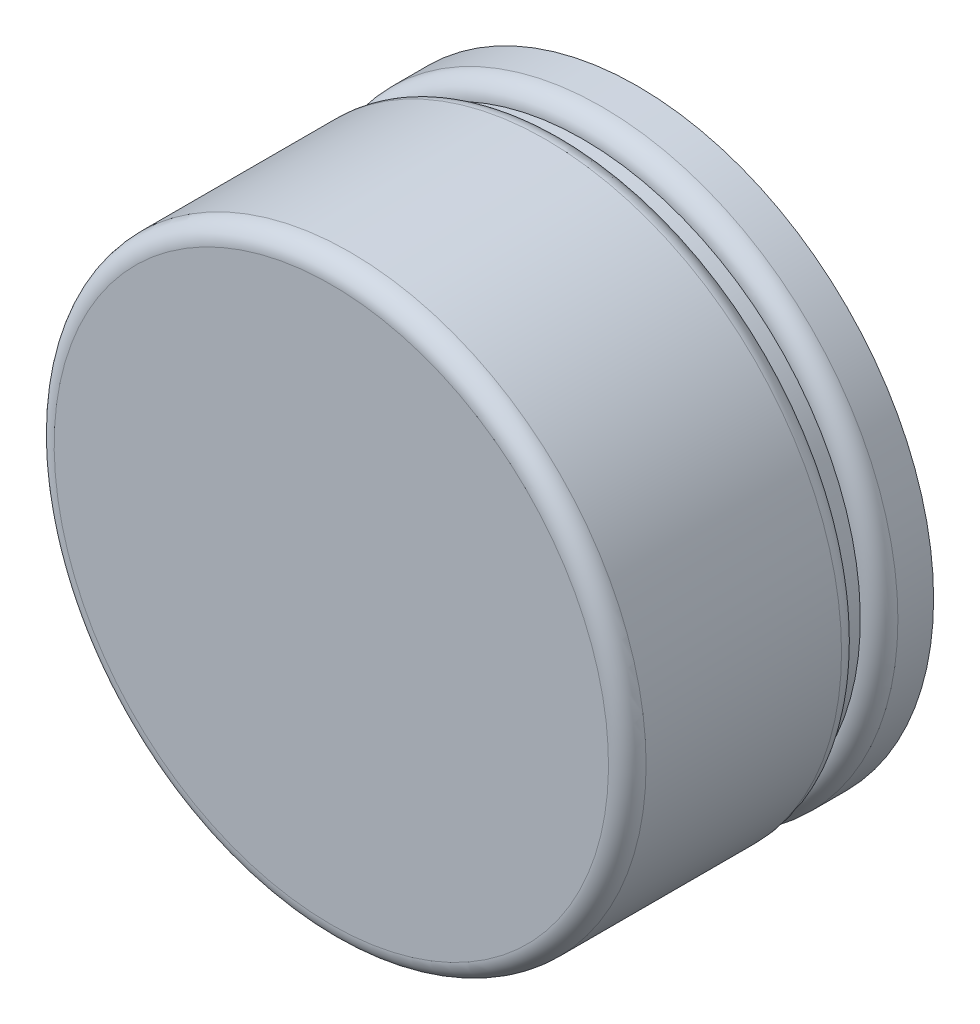
ISO-10303-21;
HEADER;
FILE_DESCRIPTION(('STEP AP214'),'2;1');
FILE_NAME('part.step','',(''),(''),'','','');
FILE_SCHEMA(('AUTOMOTIVE_DESIGN { 1 0 10303 214 1 1 1 1 }'));
ENDSEC;
DATA;
#1=APPLICATION_CONTEXT('core data for automotive mechanical design processes');
#2=APPLICATION_PROTOCOL_DEFINITION('international standard','automotive_design',2000,#1);
#3=PRODUCT_CONTEXT('',#1,'mechanical');
#4=PRODUCT('Part','Part','',(#3));
#5=PRODUCT_RELATED_PRODUCT_CATEGORY('part','',(#4));
#6=PRODUCT_DEFINITION_FORMATION('','',#4);
#7=PRODUCT_DEFINITION_CONTEXT('part definition',#1,'design');
#8=PRODUCT_DEFINITION('design','',#6,#7);
#9=PRODUCT_DEFINITION_SHAPE('','',#8);
#10=(LENGTH_UNIT() NAMED_UNIT(*) SI_UNIT(.MILLI.,.METRE.));
#11=(NAMED_UNIT(*) PLANE_ANGLE_UNIT() SI_UNIT($,.RADIAN.));
#12=(NAMED_UNIT(*) SI_UNIT($,.STERADIAN.) SOLID_ANGLE_UNIT());
#13=UNCERTAINTY_MEASURE_WITH_UNIT(LENGTH_MEASURE(1.E-05),#10,'distance_accuracy_value','');
#14=(GEOMETRIC_REPRESENTATION_CONTEXT(3) GLOBAL_UNCERTAINTY_ASSIGNED_CONTEXT((#13)) GLOBAL_UNIT_ASSIGNED_CONTEXT((#10,
#11,#12)) REPRESENTATION_CONTEXT('',''));
#15=CARTESIAN_POINT('',(0.,0.,0.));
#16=DIRECTION('',(0.,0.,1.));
#17=DIRECTION('',(1.,0.,0.));
#18=AXIS2_PLACEMENT_3D('',#15,#16,#17);
#19=CARTESIAN_POINT('',(-3.62999782,0.94000066,3.89999982));
#20=DIRECTION('',(0.,0.,-1.));
#21=DIRECTION('',(-1.,0.,0.));
#22=AXIS2_PLACEMENT_3D('',#19,#20,#21);
#23=PLANE('',#22);
#24=CARTESIAN_POINT('',(2.54000000069268E-06,-2.81420062,3.89999982));
#25=DIRECTION('',(0.,0.,1.));
#26=DIRECTION('',(0.,-1.,0.));
#27=AXIS2_PLACEMENT_3D('',#24,#25,#26);
#28=CIRCLE('',#27,2.95000000023);
#29=CARTESIAN_POINT('',(2.54000000069268E-06,-5.76420062023,3.89999982));
#30=VERTEX_POINT('',#29);
#31=EDGE_CURVE('E18',#30,#30,#28,.F.);
#32=ORIENTED_EDGE('',*,*,#31,.F.);
#33=EDGE_LOOP('',(#32));
#34=FACE_BOUND('',#33,.T.);
#35=ADVANCED_FACE('F14',(#34),#23,.F.);
#36=CARTESIAN_POINT('',(2.54000000069268E-06,-2.81420062,3.69999982));
#37=DIRECTION('',(0.,0.,1.));
#38=DIRECTION('',(0.,-1.,0.));
#39=AXIS2_PLACEMENT_3D('',#36,#37,#38);
#40=TOROIDAL_SURFACE('',#39,2.95000000023,0.200000000000001);
#41=ORIENTED_EDGE('',*,*,#31,.T.);
#42=EDGE_LOOP('',(#41));
#43=FACE_BOUND('',#42,.T.);
#44=CARTESIAN_POINT('',(2.54000000055E-06,-2.81420062,3.69999982));
#45=DIRECTION('',(0.,0.,-1.));
#46=DIRECTION('',(-1.,0.,0.));
#47=AXIS2_PLACEMENT_3D('',#44,#45,#46);
#48=CIRCLE('',#47,3.15000000023);
#49=CARTESIAN_POINT('',(-3.14999746023,-2.81420062,3.69999982));
#50=VERTEX_POINT('',#49);
#51=EDGE_CURVE('E29',#50,#50,#48,.T.);
#52=ORIENTED_EDGE('',*,*,#51,.F.);
#53=EDGE_LOOP('',(#52));
#54=FACE_BOUND('',#53,.T.);
#55=ADVANCED_FACE('F16',(#43,#54),#40,.T.);
#56=CARTESIAN_POINT('',(2.54000000055E-06,-2.81420062,5.21999996));
#57=DIRECTION('',(0.,0.,-1.));
#58=DIRECTION('',(-1.,0.,0.));
#59=AXIS2_PLACEMENT_3D('',#56,#57,#58);
#60=CYLINDRICAL_SURFACE('',#59,3.15000000023);
#61=CARTESIAN_POINT('',(2.540000000259E-06,-2.81420062,1.61999996));
#62=DIRECTION('',(0.,0.,-1.));
#63=DIRECTION('',(0.,1.,0.));
#64=AXIS2_PLACEMENT_3D('',#61,#62,#63);
#65=CIRCLE('',#64,3.15000000042909);
#66=CARTESIAN_POINT('',(2.540000000259E-06,0.335799380429093,1.61999996));
#67=VERTEX_POINT('',#66);
#68=EDGE_CURVE('E32',#67,#67,#65,.T.);
#69=ORIENTED_EDGE('',*,*,#68,.F.);
#70=EDGE_LOOP('',(#69));
#71=FACE_BOUND('',#70,.T.);
#72=ORIENTED_EDGE('',*,*,#51,.T.);
#73=EDGE_LOOP('',(#72));
#74=FACE_BOUND('',#73,.T.);
#75=ADVANCED_FACE('F47',(#71,#74),#60,.T.);
#76=CARTESIAN_POINT('',(2.540000000259E-06,-2.81420062,1.61999996));
#77=DIRECTION('',(0.,0.,-1.));
#78=DIRECTION('',(0.,1.,0.));
#79=AXIS2_PLACEMENT_3D('',#76,#77,#78);
#80=TOROIDAL_SURFACE('',#79,2.95000000042795,0.200000000001143);
#81=ORIENTED_EDGE('',*,*,#68,.T.);
#82=EDGE_LOOP('',(#81));
#83=FACE_BOUND('',#82,.T.);
#84=CARTESIAN_POINT('',(2.54000000055E-06,-2.81420062,1.41999996));
#85=DIRECTION('',(0.,0.,-1.));
#86=DIRECTION('',(-1.,0.,0.));
#87=AXIS2_PLACEMENT_3D('',#84,#85,#86);
#88=CIRCLE('',#87,2.950000000428);
#89=CARTESIAN_POINT('',(-2.949997460428,-2.81420062,1.41999996));
#90=VERTEX_POINT('',#89);
#91=EDGE_CURVE('E35',#90,#90,#88,.T.);
#92=ORIENTED_EDGE('',*,*,#91,.F.);
#93=EDGE_LOOP('',(#92));
#94=FACE_BOUND('',#93,.T.);
#95=ADVANCED_FACE('F42',(#83,#94),#80,.T.);
#96=CARTESIAN_POINT('',(2.54000000055E-06,-2.81420062,1.41999996));
#97=DIRECTION('',(0.,0.,-1.));
#98=DIRECTION('',(-1.,0.,0.));
#99=AXIS2_PLACEMENT_3D('',#96,#97,#98);
#100=CYLINDRICAL_SURFACE('',#99,2.950000000428);
#101=CARTESIAN_POINT('',(2.54000000025548E-06,-2.81420062,1.21999995999997));
#102=DIRECTION('',(0.,0.,-1.));
#103=DIRECTION('',(0.,1.,0.));
#104=AXIS2_PLACEMENT_3D('',#101,#102,#103);
#105=CIRCLE('',#104,2.95000000042795);
#106=CARTESIAN_POINT('',(2.54000000025548E-06,0.13579938042795,1.21999995999997));
#107=VERTEX_POINT('',#106);
#108=EDGE_CURVE('E26',#107,#107,#105,.T.);
#109=ORIENTED_EDGE('',*,*,#108,.F.);
#110=EDGE_LOOP('',(#109));
#111=FACE_BOUND('',#110,.T.);
#112=ORIENTED_EDGE('',*,*,#91,.T.);
#113=EDGE_LOOP('',(#112));
#114=FACE_BOUND('',#113,.T.);
#115=ADVANCED_FACE('F46',(#111,#114),#100,.T.);
#116=CARTESIAN_POINT('',(2.540000000259E-06,-2.81420062,1.01999996));
#117=DIRECTION('',(0.,0.,-1.));
#118=DIRECTION('',(0.,1.,0.));
#119=AXIS2_PLACEMENT_3D('',#116,#117,#118);
#120=TOROIDAL_SURFACE('',#119,2.95000000042795,0.199999999999965);
#121=ORIENTED_EDGE('',*,*,#108,.T.);
#122=EDGE_LOOP('',(#121));
#123=FACE_BOUND('',#122,.T.);
#124=CARTESIAN_POINT('',(2.54000000055E-06,-2.81420062,1.01999996));
#125=DIRECTION('',(0.,0.,-1.));
#126=DIRECTION('',(-1.,0.,0.));
#127=AXIS2_PLACEMENT_3D('',#124,#125,#126);
#128=CIRCLE('',#127,3.15000000023);
#129=CARTESIAN_POINT('',(-3.14999746023,-2.81420062,1.01999996));
#130=VERTEX_POINT('',#129);
#131=EDGE_CURVE('E22',#130,#130,#128,.T.);
#132=ORIENTED_EDGE('',*,*,#131,.F.);
#133=EDGE_LOOP('',(#132));
#134=FACE_BOUND('',#133,.T.);
#135=ADVANCED_FACE('F67',(#123,#134),#120,.T.);
#136=CARTESIAN_POINT('',(2.54000000055E-06,-2.81420062,1.01999996));
#137=DIRECTION('',(0.,0.,-1.));
#138=DIRECTION('',(-1.,0.,0.));
#139=AXIS2_PLACEMENT_3D('',#136,#137,#138);
#140=CYLINDRICAL_SURFACE('',#139,3.15000000023);
#141=ORIENTED_EDGE('',*,*,#131,.T.);
#142=EDGE_LOOP('',(#141));
#143=FACE_BOUND('',#142,.T.);
#144=CARTESIAN_POINT('',(2.54000000055E-06,-2.81420062,0.64000126));
#145=DIRECTION('',(0.,0.,-1.));
#146=DIRECTION('',(-1.,0.,0.));
#147=AXIS2_PLACEMENT_3D('',#144,#145,#146);
#148=CIRCLE('',#147,3.15000000023);
#149=CARTESIAN_POINT('',(-3.14999746023,-2.81420062,0.64000126));
#150=VERTEX_POINT('',#149);
#151=EDGE_CURVE('E10',#150,#150,#148,.T.);
#152=ORIENTED_EDGE('',*,*,#151,.F.);
#153=EDGE_LOOP('',(#152));
#154=FACE_BOUND('',#153,.T.);
#155=ADVANCED_FACE('F62',(#143,#154),#140,.T.);
#156=CARTESIAN_POINT('',(-4.11999684,1.30999992,0.64000126));
#157=DIRECTION('',(0.,0.,-1.));
#158=DIRECTION('',(-1.,0.,0.));
#159=AXIS2_PLACEMENT_3D('',#156,#157,#158);
#160=PLANE('',#159);
#161=ORIENTED_EDGE('',*,*,#151,.T.);
#162=EDGE_LOOP('',(#161));
#163=FACE_BOUND('',#162,.T.);
#164=ADVANCED_FACE('F60',(#163),#160,.T.);
#165=CLOSED_SHELL('',(#35,#55,#75,#95,#115,#135,#155,#164));
#166=MANIFOLD_SOLID_BREP('B1',#165);
#167=ADVANCED_BREP_SHAPE_REPRESENTATION('',(#18,#166),#14);
#168=SHAPE_DEFINITION_REPRESENTATION(#9,#167);
ENDSEC;
END-ISO-10303-21;
